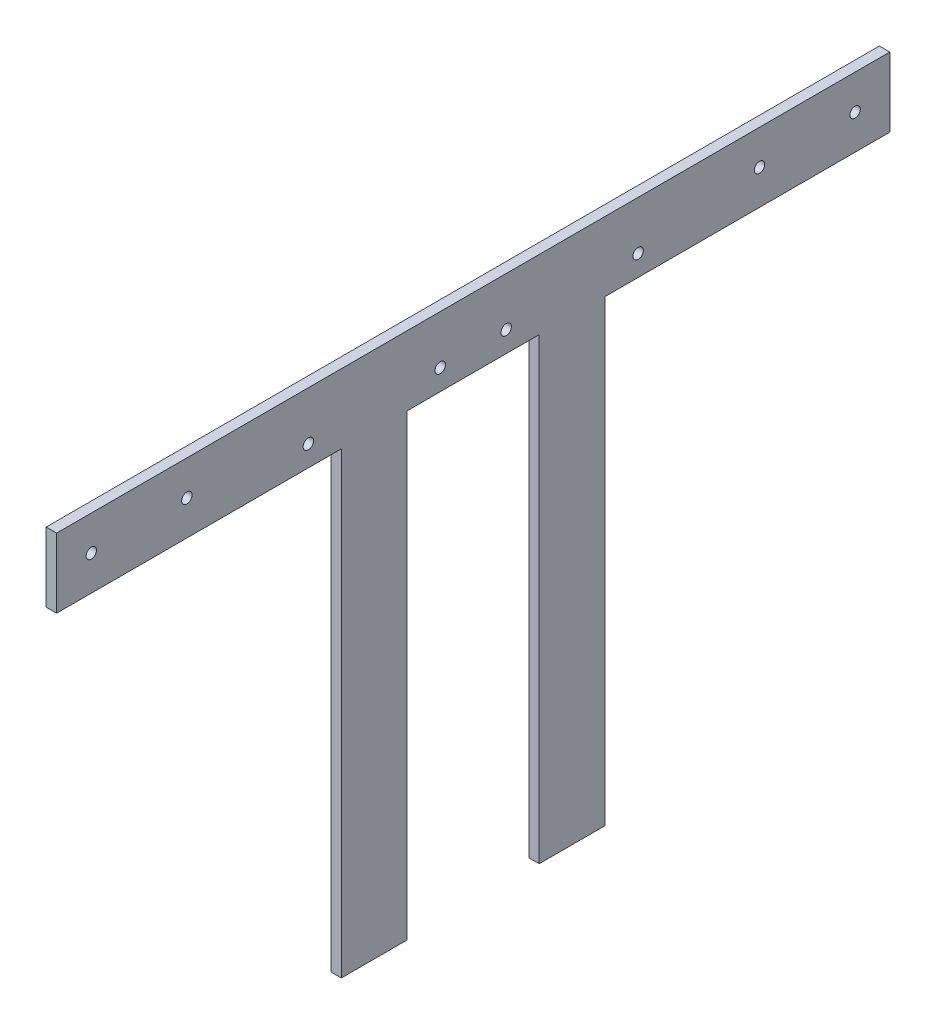
ISO-10303-21;
HEADER;
FILE_DESCRIPTION(('STEP AP214'),'2;1');
FILE_NAME('part.step','',(''),(''),'','','');
FILE_SCHEMA(('AUTOMOTIVE_DESIGN { 1 0 10303 214 1 1 1 1 }'));
ENDSEC;
DATA;
#1=APPLICATION_CONTEXT('core data for automotive mechanical design processes');
#2=APPLICATION_PROTOCOL_DEFINITION('international standard','automotive_design',2000,#1);
#3=PRODUCT_CONTEXT('',#1,'mechanical');
#4=PRODUCT('Part','Part','',(#3));
#5=PRODUCT_RELATED_PRODUCT_CATEGORY('part','',(#4));
#6=PRODUCT_DEFINITION_FORMATION('','',#4);
#7=PRODUCT_DEFINITION_CONTEXT('part definition',#1,'design');
#8=PRODUCT_DEFINITION('design','',#6,#7);
#9=PRODUCT_DEFINITION_SHAPE('','',#8);
#10=(LENGTH_UNIT() NAMED_UNIT(*) SI_UNIT(.MILLI.,.METRE.));
#11=(NAMED_UNIT(*) PLANE_ANGLE_UNIT() SI_UNIT($,.RADIAN.));
#12=(NAMED_UNIT(*) SI_UNIT($,.STERADIAN.) SOLID_ANGLE_UNIT());
#13=UNCERTAINTY_MEASURE_WITH_UNIT(LENGTH_MEASURE(1.E-05),#10,'distance_accuracy_value','');
#14=(GEOMETRIC_REPRESENTATION_CONTEXT(3) GLOBAL_UNCERTAINTY_ASSIGNED_CONTEXT((#13)) GLOBAL_UNIT_ASSIGNED_CONTEXT((#10,
#11,#12)) REPRESENTATION_CONTEXT('',''));
#15=CARTESIAN_POINT('',(0.,0.,0.));
#16=DIRECTION('',(0.,0.,1.));
#17=DIRECTION('',(1.,0.,0.));
#18=AXIS2_PLACEMENT_3D('',#15,#16,#17);
#19=CARTESIAN_POINT('',(3.,0.,0.));
#20=DIRECTION('',(1.,0.,0.));
#21=DIRECTION('',(0.,0.,-1.));
#22=AXIS2_PLACEMENT_3D('',#19,#20,#21);
#23=PLANE('',#22);
#24=CARTESIAN_POINT('',(3.,-10.,-37.52));
#25=DIRECTION('',(1.,0.,0.));
#26=DIRECTION('',(0.,0.,-1.));
#27=AXIS2_PLACEMENT_3D('',#24,#25,#26);
#28=CIRCLE('',#27,1.5);
#29=CARTESIAN_POINT('',(3.,-10.,-39.02));
#30=VERTEX_POINT('',#29);
#31=EDGE_CURVE('E309',#30,#30,#28,.T.);
#32=ORIENTED_EDGE('',*,*,#31,.F.);
#33=EDGE_LOOP('',(#32));
#34=FACE_BOUND('',#33,.T.);
#35=CARTESIAN_POINT('',(3.,-10.,-10.));
#36=DIRECTION('',(1.,0.,0.));
#37=DIRECTION('',(0.,0.,-1.));
#38=AXIS2_PLACEMENT_3D('',#35,#36,#37);
#39=CIRCLE('',#38,1.5);
#40=CARTESIAN_POINT('',(3.,-10.,-11.5));
#41=VERTEX_POINT('',#40);
#42=EDGE_CURVE('E321',#41,#41,#39,.T.);
#43=ORIENTED_EDGE('',*,*,#42,.F.);
#44=EDGE_LOOP('',(#43));
#45=FACE_BOUND('',#44,.T.);
#46=CARTESIAN_POINT('',(3.,-14.,-129.5));
#47=DIRECTION('',(1.,0.,0.));
#48=DIRECTION('',(0.,0.,1.));
#49=AXIS2_PLACEMENT_3D('',#46,#47,#48);
#50=CIRCLE('',#49,1.5);
#51=CARTESIAN_POINT('',(3.,-14.,-128.));
#52=VERTEX_POINT('',#51);
#53=EDGE_CURVE('E333',#52,#52,#50,.T.);
#54=ORIENTED_EDGE('',*,*,#53,.F.);
#55=EDGE_LOOP('',(#54));
#56=FACE_BOUND('',#55,.T.);
#57=CARTESIAN_POINT('',(3.,-14.,-72.5));
#58=DIRECTION('',(1.,0.,0.));
#59=DIRECTION('',(0.,0.,-1.));
#60=AXIS2_PLACEMENT_3D('',#57,#58,#59);
#61=CIRCLE('',#60,1.5);
#62=CARTESIAN_POINT('',(3.,-14.,-74.));
#63=VERTEX_POINT('',#62);
#64=EDGE_CURVE('E160',#63,#63,#61,.T.);
#65=ORIENTED_EDGE('',*,*,#64,.F.);
#66=EDGE_LOOP('',(#65));
#67=FACE_BOUND('',#66,.T.);
#68=DIRECTION('',(0.,-1.,0.));
#69=VECTOR('',#68,1.);
#70=CARTESIAN_POINT('',(3.,0.,0.));
#71=LINE('',#70,#69);
#72=CARTESIAN_POINT('',(3.,0.,0.));
#73=VERTEX_POINT('',#72);
#74=CARTESIAN_POINT('',(3.,-20.,0.));
#75=VERTEX_POINT('',#74);
#76=EDGE_CURVE('E179',#73,#75,#71,.T.);
#77=ORIENTED_EDGE('',*,*,#76,.T.);
#78=DIRECTION('',(0.,0.,-1.));
#79=VECTOR('',#78,1.);
#80=CARTESIAN_POINT('',(3.,-20.,0.));
#81=LINE('',#80,#79);
#82=CARTESIAN_POINT('',(3.,-20.,-82.));
#83=VERTEX_POINT('',#82);
#84=EDGE_CURVE('E107',#75,#83,#81,.T.);
#85=ORIENTED_EDGE('',*,*,#84,.T.);
#86=DIRECTION('',(0.,-1.,0.));
#87=VECTOR('',#86,1.);
#88=CARTESIAN_POINT('',(3.,-20.,-82.));
#89=LINE('',#88,#87);
#90=CARTESIAN_POINT('',(3.,-152.,-82.));
#91=VERTEX_POINT('',#90);
#92=EDGE_CURVE('E206',#83,#91,#89,.T.);
#93=ORIENTED_EDGE('',*,*,#92,.T.);
#94=DIRECTION('',(0.,0.,-1.));
#95=VECTOR('',#94,1.);
#96=CARTESIAN_POINT('',(3.,-152.,-82.));
#97=LINE('',#96,#95);
#98=CARTESIAN_POINT('',(3.,-152.,-101.));
#99=VERTEX_POINT('',#98);
#100=EDGE_CURVE('E225',#91,#99,#97,.T.);
#101=ORIENTED_EDGE('',*,*,#100,.T.);
#102=DIRECTION('',(0.,1.,0.));
#103=VECTOR('',#102,1.);
#104=CARTESIAN_POINT('',(3.,-20.,-101.));
#105=LINE('',#104,#103);
#106=CARTESIAN_POINT('',(3.,-20.,-101.));
#107=VERTEX_POINT('',#106);
#108=EDGE_CURVE('E222',#99,#107,#105,.T.);
#109=ORIENTED_EDGE('',*,*,#108,.T.);
#110=DIRECTION('',(0.,0.,-1.));
#111=VECTOR('',#110,1.);
#112=CARTESIAN_POINT('',(3.,-20.,-101.));
#113=LINE('',#112,#111);
#114=CARTESIAN_POINT('',(3.,-20.,-139.));
#115=VERTEX_POINT('',#114);
#116=EDGE_CURVE('E224',#107,#115,#113,.T.);
#117=ORIENTED_EDGE('',*,*,#116,.T.);
#118=DIRECTION('',(0.,-1.,0.));
#119=VECTOR('',#118,1.);
#120=CARTESIAN_POINT('',(3.,-20.,-139.));
#121=LINE('',#120,#119);
#122=CARTESIAN_POINT('',(3.,-152.,-139.));
#123=VERTEX_POINT('',#122);
#124=EDGE_CURVE('E227',#115,#123,#121,.T.);
#125=ORIENTED_EDGE('',*,*,#124,.T.);
#126=DIRECTION('',(0.,0.,-1.));
#127=VECTOR('',#126,1.);
#128=CARTESIAN_POINT('',(3.,-152.,-158.));
#129=LINE('',#128,#127);
#130=CARTESIAN_POINT('',(3.,-152.,-158.));
#131=VERTEX_POINT('',#130);
#132=EDGE_CURVE('E233',#123,#131,#129,.T.);
#133=ORIENTED_EDGE('',*,*,#132,.T.);
#134=DIRECTION('',(0.,1.,0.));
#135=VECTOR('',#134,1.);
#136=CARTESIAN_POINT('',(3.,-20.,-158.));
#137=LINE('',#136,#135);
#138=CARTESIAN_POINT('',(3.,-20.,-158.));
#139=VERTEX_POINT('',#138);
#140=EDGE_CURVE('E138',#131,#139,#137,.T.);
#141=ORIENTED_EDGE('',*,*,#140,.T.);
#142=DIRECTION('',(0.,0.,-1.));
#143=VECTOR('',#142,1.);
#144=CARTESIAN_POINT('',(3.,-20.,-158.));
#145=LINE('',#144,#143);
#146=CARTESIAN_POINT('',(3.,-20.,-240.));
#147=VERTEX_POINT('',#146);
#148=EDGE_CURVE('E132',#139,#147,#145,.T.);
#149=ORIENTED_EDGE('',*,*,#148,.T.);
#150=DIRECTION('',(0.,1.,0.));
#151=VECTOR('',#150,1.);
#152=CARTESIAN_POINT('',(3.,0.,-240.));
#153=LINE('',#152,#151);
#154=CARTESIAN_POINT('',(3.,0.,-240.));
#155=VERTEX_POINT('',#154);
#156=EDGE_CURVE('E136',#147,#155,#153,.T.);
#157=ORIENTED_EDGE('',*,*,#156,.T.);
#158=DIRECTION('',(0.,0.,1.));
#159=VECTOR('',#158,1.);
#160=CARTESIAN_POINT('',(3.,0.,0.));
#161=LINE('',#160,#159);
#162=EDGE_CURVE('E52',#155,#73,#161,.T.);
#163=ORIENTED_EDGE('',*,*,#162,.T.);
#164=EDGE_LOOP('',(#77,#85,#93,#101,#109,#117,#125,#133,#141,#149,#157,#163));
#165=FACE_BOUND('',#164,.T.);
#166=CARTESIAN_POINT('',(3.,-14.,-110.5));
#167=DIRECTION('',(1.,0.,0.));
#168=DIRECTION('',(0.,0.,-1.));
#169=AXIS2_PLACEMENT_3D('',#166,#167,#168);
#170=CIRCLE('',#169,1.5);
#171=CARTESIAN_POINT('',(3.,-14.,-112.));
#172=VERTEX_POINT('',#171);
#173=EDGE_CURVE('E339',#172,#172,#170,.T.);
#174=ORIENTED_EDGE('',*,*,#173,.F.);
#175=EDGE_LOOP('',(#174));
#176=FACE_BOUND('',#175,.T.);
#177=CARTESIAN_POINT('',(3.,-14.,-167.5));
#178=DIRECTION('',(1.,0.,0.));
#179=DIRECTION('',(0.,0.,1.));
#180=AXIS2_PLACEMENT_3D('',#177,#178,#179);
#181=CIRCLE('',#180,1.5);
#182=CARTESIAN_POINT('',(3.,-14.,-166.));
#183=VERTEX_POINT('',#182);
#184=EDGE_CURVE('E327',#183,#183,#181,.T.);
#185=ORIENTED_EDGE('',*,*,#184,.F.);
#186=EDGE_LOOP('',(#185));
#187=FACE_BOUND('',#186,.T.);
#188=CARTESIAN_POINT('',(3.,-10.,-230.));
#189=DIRECTION('',(1.,0.,0.));
#190=DIRECTION('',(0.,0.,1.));
#191=AXIS2_PLACEMENT_3D('',#188,#189,#190);
#192=CIRCLE('',#191,1.50000000000002);
#193=CARTESIAN_POINT('',(3.,-10.,-228.5));
#194=VERTEX_POINT('',#193);
#195=EDGE_CURVE('E315',#194,#194,#192,.T.);
#196=ORIENTED_EDGE('',*,*,#195,.F.);
#197=EDGE_LOOP('',(#196));
#198=FACE_BOUND('',#197,.T.);
#199=CARTESIAN_POINT('',(3.,-10.,-202.48));
#200=DIRECTION('',(1.,0.,0.));
#201=DIRECTION('',(0.,0.,1.));
#202=AXIS2_PLACEMENT_3D('',#199,#200,#201);
#203=CIRCLE('',#202,1.49999999999997);
#204=CARTESIAN_POINT('',(3.,-10.,-200.98));
#205=VERTEX_POINT('',#204);
#206=EDGE_CURVE('E300',#205,#205,#203,.T.);
#207=ORIENTED_EDGE('',*,*,#206,.F.);
#208=EDGE_LOOP('',(#207));
#209=FACE_BOUND('',#208,.T.);
#210=ADVANCED_FACE('F35',(#34,#45,#56,#67,#165,#176,#187,#198,#209),#23,.T.);
#211=CARTESIAN_POINT('',(0.,0.,0.));
#212=DIRECTION('',(1.,0.,0.));
#213=DIRECTION('',(0.,0.,-1.));
#214=AXIS2_PLACEMENT_3D('',#211,#212,#213);
#215=PLANE('',#214);
#216=DIRECTION('',(0.,-1.,0.));
#217=VECTOR('',#216,1.);
#218=CARTESIAN_POINT('',(0.,0.,0.));
#219=LINE('',#218,#217);
#220=CARTESIAN_POINT('',(0.,0.,0.));
#221=VERTEX_POINT('',#220);
#222=CARTESIAN_POINT('',(0.,-20.,0.));
#223=VERTEX_POINT('',#222);
#224=EDGE_CURVE('E156',#221,#223,#219,.T.);
#225=ORIENTED_EDGE('',*,*,#224,.F.);
#226=DIRECTION('',(0.,0.,1.));
#227=VECTOR('',#226,1.);
#228=CARTESIAN_POINT('',(0.,0.,0.));
#229=LINE('',#228,#227);
#230=CARTESIAN_POINT('',(0.,0.,-240.));
#231=VERTEX_POINT('',#230);
#232=EDGE_CURVE('E99',#231,#221,#229,.T.);
#233=ORIENTED_EDGE('',*,*,#232,.F.);
#234=DIRECTION('',(0.,1.,0.));
#235=VECTOR('',#234,1.);
#236=CARTESIAN_POINT('',(0.,0.,-240.));
#237=LINE('',#236,#235);
#238=CARTESIAN_POINT('',(0.,-20.,-240.));
#239=VERTEX_POINT('',#238);
#240=EDGE_CURVE('E93',#239,#231,#237,.T.);
#241=ORIENTED_EDGE('',*,*,#240,.F.);
#242=DIRECTION('',(0.,0.,-1.));
#243=VECTOR('',#242,1.);
#244=CARTESIAN_POINT('',(0.,-20.,-158.));
#245=LINE('',#244,#243);
#246=CARTESIAN_POINT('',(0.,-20.,-158.));
#247=VERTEX_POINT('',#246);
#248=EDGE_CURVE('E146',#247,#239,#245,.T.);
#249=ORIENTED_EDGE('',*,*,#248,.F.);
#250=DIRECTION('',(0.,1.,0.));
#251=VECTOR('',#250,1.);
#252=CARTESIAN_POINT('',(0.,-20.,-158.));
#253=LINE('',#252,#251);
#254=CARTESIAN_POINT('',(0.,-152.,-158.));
#255=VERTEX_POINT('',#254);
#256=EDGE_CURVE('E174',#255,#247,#253,.T.);
#257=ORIENTED_EDGE('',*,*,#256,.F.);
#258=DIRECTION('',(0.,0.,-1.));
#259=VECTOR('',#258,1.);
#260=CARTESIAN_POINT('',(0.,-152.,-158.));
#261=LINE('',#260,#259);
#262=CARTESIAN_POINT('',(0.,-152.,-139.));
#263=VERTEX_POINT('',#262);
#264=EDGE_CURVE('E172',#263,#255,#261,.T.);
#265=ORIENTED_EDGE('',*,*,#264,.F.);
#266=DIRECTION('',(0.,-1.,0.));
#267=VECTOR('',#266,1.);
#268=CARTESIAN_POINT('',(0.,-20.,-139.));
#269=LINE('',#268,#267);
#270=CARTESIAN_POINT('',(0.,-20.,-139.));
#271=VERTEX_POINT('',#270);
#272=EDGE_CURVE('E170',#271,#263,#269,.T.);
#273=ORIENTED_EDGE('',*,*,#272,.F.);
#274=DIRECTION('',(0.,0.,-1.));
#275=VECTOR('',#274,1.);
#276=CARTESIAN_POINT('',(0.,-20.,-101.));
#277=LINE('',#276,#275);
#278=CARTESIAN_POINT('',(0.,-20.,-101.));
#279=VERTEX_POINT('',#278);
#280=EDGE_CURVE('E168',#279,#271,#277,.T.);
#281=ORIENTED_EDGE('',*,*,#280,.F.);
#282=DIRECTION('',(0.,1.,0.));
#283=VECTOR('',#282,1.);
#284=CARTESIAN_POINT('',(0.,-20.,-101.));
#285=LINE('',#284,#283);
#286=CARTESIAN_POINT('',(0.,-152.,-101.));
#287=VERTEX_POINT('',#286);
#288=EDGE_CURVE('E166',#287,#279,#285,.T.);
#289=ORIENTED_EDGE('',*,*,#288,.F.);
#290=DIRECTION('',(0.,0.,-1.));
#291=VECTOR('',#290,1.);
#292=CARTESIAN_POINT('',(0.,-152.,-82.));
#293=LINE('',#292,#291);
#294=CARTESIAN_POINT('',(0.,-152.,-82.));
#295=VERTEX_POINT('',#294);
#296=EDGE_CURVE('E164',#295,#287,#293,.T.);
#297=ORIENTED_EDGE('',*,*,#296,.F.);
#298=DIRECTION('',(0.,-1.,0.));
#299=VECTOR('',#298,1.);
#300=CARTESIAN_POINT('',(0.,-20.,-82.));
#301=LINE('',#300,#299);
#302=CARTESIAN_POINT('',(0.,-20.,-82.));
#303=VERTEX_POINT('',#302);
#304=EDGE_CURVE('E162',#303,#295,#301,.T.);
#305=ORIENTED_EDGE('',*,*,#304,.F.);
#306=DIRECTION('',(0.,0.,-1.));
#307=VECTOR('',#306,1.);
#308=CARTESIAN_POINT('',(0.,-20.,0.));
#309=LINE('',#308,#307);
#310=EDGE_CURVE('E159',#223,#303,#309,.T.);
#311=ORIENTED_EDGE('',*,*,#310,.F.);
#312=EDGE_LOOP('',(#225,#233,#241,#249,#257,#265,#273,#281,#289,#297,#305,#311));
#313=FACE_BOUND('',#312,.T.);
#314=CARTESIAN_POINT('',(0.,-14.,-72.5));
#315=DIRECTION('',(1.,0.,0.));
#316=DIRECTION('',(0.,0.,-1.));
#317=AXIS2_PLACEMENT_3D('',#314,#315,#316);
#318=CIRCLE('',#317,1.5);
#319=CARTESIAN_POINT('',(0.,-14.,-74.));
#320=VERTEX_POINT('',#319);
#321=EDGE_CURVE('E342',#320,#320,#318,.T.);
#322=ORIENTED_EDGE('',*,*,#321,.T.);
#323=EDGE_LOOP('',(#322));
#324=FACE_BOUND('',#323,.T.);
#325=CARTESIAN_POINT('',(0.,-14.,-110.5));
#326=DIRECTION('',(1.,0.,0.));
#327=DIRECTION('',(0.,0.,-1.));
#328=AXIS2_PLACEMENT_3D('',#325,#326,#327);
#329=CIRCLE('',#328,1.5);
#330=CARTESIAN_POINT('',(0.,-14.,-112.));
#331=VERTEX_POINT('',#330);
#332=EDGE_CURVE('E336',#331,#331,#329,.T.);
#333=ORIENTED_EDGE('',*,*,#332,.T.);
#334=EDGE_LOOP('',(#333));
#335=FACE_BOUND('',#334,.T.);
#336=CARTESIAN_POINT('',(0.,-14.,-129.5));
#337=DIRECTION('',(1.,0.,0.));
#338=DIRECTION('',(0.,0.,1.));
#339=AXIS2_PLACEMENT_3D('',#336,#337,#338);
#340=CIRCLE('',#339,1.5);
#341=CARTESIAN_POINT('',(0.,-14.,-128.));
#342=VERTEX_POINT('',#341);
#343=EDGE_CURVE('E330',#342,#342,#340,.T.);
#344=ORIENTED_EDGE('',*,*,#343,.T.);
#345=EDGE_LOOP('',(#344));
#346=FACE_BOUND('',#345,.T.);
#347=CARTESIAN_POINT('',(0.,-14.,-167.5));
#348=DIRECTION('',(1.,0.,0.));
#349=DIRECTION('',(0.,0.,1.));
#350=AXIS2_PLACEMENT_3D('',#347,#348,#349);
#351=CIRCLE('',#350,1.5);
#352=CARTESIAN_POINT('',(0.,-14.,-166.));
#353=VERTEX_POINT('',#352);
#354=EDGE_CURVE('E324',#353,#353,#351,.T.);
#355=ORIENTED_EDGE('',*,*,#354,.T.);
#356=EDGE_LOOP('',(#355));
#357=FACE_BOUND('',#356,.T.);
#358=CARTESIAN_POINT('',(0.,-10.,-10.));
#359=DIRECTION('',(1.,0.,0.));
#360=DIRECTION('',(0.,0.,-1.));
#361=AXIS2_PLACEMENT_3D('',#358,#359,#360);
#362=CIRCLE('',#361,1.5);
#363=CARTESIAN_POINT('',(0.,-10.,-11.5));
#364=VERTEX_POINT('',#363);
#365=EDGE_CURVE('E318',#364,#364,#362,.T.);
#366=ORIENTED_EDGE('',*,*,#365,.T.);
#367=EDGE_LOOP('',(#366));
#368=FACE_BOUND('',#367,.T.);
#369=CARTESIAN_POINT('',(0.,-10.,-230.));
#370=DIRECTION('',(1.,0.,0.));
#371=DIRECTION('',(0.,0.,1.));
#372=AXIS2_PLACEMENT_3D('',#369,#370,#371);
#373=CIRCLE('',#372,1.50000000000002);
#374=CARTESIAN_POINT('',(0.,-10.,-228.5));
#375=VERTEX_POINT('',#374);
#376=EDGE_CURVE('E312',#375,#375,#373,.T.);
#377=ORIENTED_EDGE('',*,*,#376,.T.);
#378=EDGE_LOOP('',(#377));
#379=FACE_BOUND('',#378,.T.);
#380=CARTESIAN_POINT('',(0.,-10.,-37.52));
#381=DIRECTION('',(1.,0.,0.));
#382=DIRECTION('',(0.,0.,-1.));
#383=AXIS2_PLACEMENT_3D('',#380,#381,#382);
#384=CIRCLE('',#383,1.5);
#385=CARTESIAN_POINT('',(0.,-10.,-39.02));
#386=VERTEX_POINT('',#385);
#387=EDGE_CURVE('E306',#386,#386,#384,.T.);
#388=ORIENTED_EDGE('',*,*,#387,.T.);
#389=EDGE_LOOP('',(#388));
#390=FACE_BOUND('',#389,.T.);
#391=CARTESIAN_POINT('',(0.,-10.,-202.48));
#392=DIRECTION('',(1.,0.,0.));
#393=DIRECTION('',(0.,0.,1.));
#394=AXIS2_PLACEMENT_3D('',#391,#392,#393);
#395=CIRCLE('',#394,1.49999999999997);
#396=CARTESIAN_POINT('',(0.,-10.,-200.98));
#397=VERTEX_POINT('',#396);
#398=EDGE_CURVE('E303',#397,#397,#395,.T.);
#399=ORIENTED_EDGE('',*,*,#398,.T.);
#400=EDGE_LOOP('',(#399));
#401=FACE_BOUND('',#400,.T.);
#402=ADVANCED_FACE('F210',(#313,#324,#335,#346,#357,#368,#379,#390,#401),#215,.F.);
#403=CARTESIAN_POINT('',(3.,0.,0.));
#404=DIRECTION('',(0.,0.,-1.));
#405=DIRECTION('',(0.,1.,0.));
#406=AXIS2_PLACEMENT_3D('',#403,#404,#405);
#407=PLANE('',#406);
#408=ORIENTED_EDGE('',*,*,#224,.T.);
#409=DIRECTION('',(-1.,0.,0.));
#410=VECTOR('',#409,1.);
#411=CARTESIAN_POINT('',(3.,-20.,0.));
#412=LINE('',#411,#410);
#413=EDGE_CURVE('E11',#75,#223,#412,.T.);
#414=ORIENTED_EDGE('',*,*,#413,.F.);
#415=ORIENTED_EDGE('',*,*,#76,.F.);
#416=DIRECTION('',(-1.,0.,0.));
#417=VECTOR('',#416,1.);
#418=CARTESIAN_POINT('',(3.,0.,0.));
#419=LINE('',#418,#417);
#420=EDGE_CURVE('E152',#73,#221,#419,.T.);
#421=ORIENTED_EDGE('',*,*,#420,.T.);
#422=EDGE_LOOP('',(#408,#414,#415,#421));
#423=FACE_BOUND('',#422,.T.);
#424=ADVANCED_FACE('F37',(#423),#407,.F.);
#425=CARTESIAN_POINT('',(3.,-20.,0.));
#426=DIRECTION('',(0.,1.,0.));
#427=DIRECTION('',(0.,0.,1.));
#428=AXIS2_PLACEMENT_3D('',#425,#426,#427);
#429=PLANE('',#428);
#430=ORIENTED_EDGE('',*,*,#310,.T.);
#431=DIRECTION('',(-1.,0.,0.));
#432=VECTOR('',#431,1.);
#433=CARTESIAN_POINT('',(3.,-20.,-82.));
#434=LINE('',#433,#432);
#435=EDGE_CURVE('E44',#83,#303,#434,.T.);
#436=ORIENTED_EDGE('',*,*,#435,.F.);
#437=ORIENTED_EDGE('',*,*,#84,.F.);
#438=ORIENTED_EDGE('',*,*,#413,.T.);
#439=EDGE_LOOP('',(#430,#436,#437,#438));
#440=FACE_BOUND('',#439,.T.);
#441=ADVANCED_FACE('F488',(#440),#429,.F.);
#442=CARTESIAN_POINT('',(3.,-20.,-82.));
#443=DIRECTION('',(0.,0.,-1.));
#444=DIRECTION('',(0.,1.,0.));
#445=AXIS2_PLACEMENT_3D('',#442,#443,#444);
#446=PLANE('',#445);
#447=ORIENTED_EDGE('',*,*,#304,.T.);
#448=DIRECTION('',(-1.,0.,0.));
#449=VECTOR('',#448,1.);
#450=CARTESIAN_POINT('',(3.,-152.,-82.));
#451=LINE('',#450,#449);
#452=EDGE_CURVE('E198',#91,#295,#451,.T.);
#453=ORIENTED_EDGE('',*,*,#452,.F.);
#454=ORIENTED_EDGE('',*,*,#92,.F.);
#455=ORIENTED_EDGE('',*,*,#435,.T.);
#456=EDGE_LOOP('',(#447,#453,#454,#455));
#457=FACE_BOUND('',#456,.T.);
#458=ADVANCED_FACE('F204',(#457),#446,.F.);
#459=CARTESIAN_POINT('',(3.,-152.,-82.));
#460=DIRECTION('',(0.,1.,0.));
#461=DIRECTION('',(0.,0.,1.));
#462=AXIS2_PLACEMENT_3D('',#459,#460,#461);
#463=PLANE('',#462);
#464=ORIENTED_EDGE('',*,*,#296,.T.);
#465=DIRECTION('',(-1.,0.,0.));
#466=VECTOR('',#465,1.);
#467=CARTESIAN_POINT('',(3.,-152.,-101.));
#468=LINE('',#467,#466);
#469=EDGE_CURVE('E195',#99,#287,#468,.T.);
#470=ORIENTED_EDGE('',*,*,#469,.F.);
#471=ORIENTED_EDGE('',*,*,#100,.F.);
#472=ORIENTED_EDGE('',*,*,#452,.T.);
#473=EDGE_LOOP('',(#464,#470,#471,#472));
#474=FACE_BOUND('',#473,.T.);
#475=ADVANCED_FACE('F216',(#474),#463,.F.);
#476=CARTESIAN_POINT('',(3.,-20.,-101.));
#477=DIRECTION('',(0.,0.,1.));
#478=DIRECTION('',(0.,-1.,0.));
#479=AXIS2_PLACEMENT_3D('',#476,#477,#478);
#480=PLANE('',#479);
#481=ORIENTED_EDGE('',*,*,#288,.T.);
#482=DIRECTION('',(-1.,0.,0.));
#483=VECTOR('',#482,1.);
#484=CARTESIAN_POINT('',(3.,-20.,-101.));
#485=LINE('',#484,#483);
#486=EDGE_CURVE('E192',#107,#279,#485,.T.);
#487=ORIENTED_EDGE('',*,*,#486,.F.);
#488=ORIENTED_EDGE('',*,*,#108,.F.);
#489=ORIENTED_EDGE('',*,*,#469,.T.);
#490=EDGE_LOOP('',(#481,#487,#488,#489));
#491=FACE_BOUND('',#490,.T.);
#492=ADVANCED_FACE('F220',(#491),#480,.F.);
#493=CARTESIAN_POINT('',(3.,-20.,-101.));
#494=DIRECTION('',(0.,1.,0.));
#495=DIRECTION('',(0.,0.,1.));
#496=AXIS2_PLACEMENT_3D('',#493,#494,#495);
#497=PLANE('',#496);
#498=ORIENTED_EDGE('',*,*,#280,.T.);
#499=DIRECTION('',(-1.,0.,0.));
#500=VECTOR('',#499,1.);
#501=CARTESIAN_POINT('',(3.,-20.,-139.));
#502=LINE('',#501,#500);
#503=EDGE_CURVE('E189',#115,#271,#502,.T.);
#504=ORIENTED_EDGE('',*,*,#503,.F.);
#505=ORIENTED_EDGE('',*,*,#116,.F.);
#506=ORIENTED_EDGE('',*,*,#486,.T.);
#507=EDGE_LOOP('',(#498,#504,#505,#506));
#508=FACE_BOUND('',#507,.T.);
#509=ADVANCED_FACE('F453',(#508),#497,.F.);
#510=CARTESIAN_POINT('',(3.,-20.,-139.));
#511=DIRECTION('',(0.,0.,-1.));
#512=DIRECTION('',(-1.,0.,0.));
#513=AXIS2_PLACEMENT_3D('',#510,#511,#512);
#514=PLANE('',#513);
#515=ORIENTED_EDGE('',*,*,#272,.T.);
#516=DIRECTION('',(-1.,0.,0.));
#517=VECTOR('',#516,1.);
#518=CARTESIAN_POINT('',(3.,-152.,-139.));
#519=LINE('',#518,#517);
#520=EDGE_CURVE('E186',#123,#263,#519,.T.);
#521=ORIENTED_EDGE('',*,*,#520,.F.);
#522=ORIENTED_EDGE('',*,*,#124,.F.);
#523=ORIENTED_EDGE('',*,*,#503,.T.);
#524=EDGE_LOOP('',(#515,#521,#522,#523));
#525=FACE_BOUND('',#524,.T.);
#526=ADVANCED_FACE('F444',(#525),#514,.F.);
#527=CARTESIAN_POINT('',(3.,-152.,-158.));
#528=DIRECTION('',(0.,1.,0.));
#529=DIRECTION('',(0.,0.,1.));
#530=AXIS2_PLACEMENT_3D('',#527,#528,#529);
#531=PLANE('',#530);
#532=ORIENTED_EDGE('',*,*,#264,.T.);
#533=DIRECTION('',(-1.,0.,0.));
#534=VECTOR('',#533,1.);
#535=CARTESIAN_POINT('',(3.,-152.,-158.));
#536=LINE('',#535,#534);
#537=EDGE_CURVE('E183',#131,#255,#536,.T.);
#538=ORIENTED_EDGE('',*,*,#537,.F.);
#539=ORIENTED_EDGE('',*,*,#132,.F.);
#540=ORIENTED_EDGE('',*,*,#520,.T.);
#541=EDGE_LOOP('',(#532,#538,#539,#540));
#542=FACE_BOUND('',#541,.T.);
#543=ADVANCED_FACE('F239',(#542),#531,.F.);
#544=CARTESIAN_POINT('',(3.,-20.,-158.));
#545=DIRECTION('',(0.,0.,1.));
#546=DIRECTION('',(0.,-1.,0.));
#547=AXIS2_PLACEMENT_3D('',#544,#545,#546);
#548=PLANE('',#547);
#549=ORIENTED_EDGE('',*,*,#256,.T.);
#550=DIRECTION('',(-1.,0.,0.));
#551=VECTOR('',#550,1.);
#552=CARTESIAN_POINT('',(3.,-20.,-158.));
#553=LINE('',#552,#551);
#554=EDGE_CURVE('E147',#139,#247,#553,.T.);
#555=ORIENTED_EDGE('',*,*,#554,.F.);
#556=ORIENTED_EDGE('',*,*,#140,.F.);
#557=ORIENTED_EDGE('',*,*,#537,.T.);
#558=EDGE_LOOP('',(#549,#555,#556,#557));
#559=FACE_BOUND('',#558,.T.);
#560=ADVANCED_FACE('F243',(#559),#548,.F.);
#561=CARTESIAN_POINT('',(3.,-20.,-158.));
#562=DIRECTION('',(0.,1.,0.));
#563=DIRECTION('',(0.,0.,1.));
#564=AXIS2_PLACEMENT_3D('',#561,#562,#563);
#565=PLANE('',#564);
#566=ORIENTED_EDGE('',*,*,#248,.T.);
#567=DIRECTION('',(-1.,0.,0.));
#568=VECTOR('',#567,1.);
#569=CARTESIAN_POINT('',(3.,-20.,-240.));
#570=LINE('',#569,#568);
#571=EDGE_CURVE('E143',#147,#239,#570,.T.);
#572=ORIENTED_EDGE('',*,*,#571,.F.);
#573=ORIENTED_EDGE('',*,*,#148,.F.);
#574=ORIENTED_EDGE('',*,*,#554,.T.);
#575=EDGE_LOOP('',(#566,#572,#573,#574));
#576=FACE_BOUND('',#575,.T.);
#577=ADVANCED_FACE('F144',(#576),#565,.F.);
#578=CARTESIAN_POINT('',(3.,0.,-240.));
#579=DIRECTION('',(0.,0.,1.));
#580=DIRECTION('',(1.,0.,0.));
#581=AXIS2_PLACEMENT_3D('',#578,#579,#580);
#582=PLANE('',#581);
#583=ORIENTED_EDGE('',*,*,#240,.T.);
#584=DIRECTION('',(-1.,0.,0.));
#585=VECTOR('',#584,1.);
#586=CARTESIAN_POINT('',(3.,0.,-240.));
#587=LINE('',#586,#585);
#588=EDGE_CURVE('E148',#155,#231,#587,.T.);
#589=ORIENTED_EDGE('',*,*,#588,.F.);
#590=ORIENTED_EDGE('',*,*,#156,.F.);
#591=ORIENTED_EDGE('',*,*,#571,.T.);
#592=EDGE_LOOP('',(#583,#589,#590,#591));
#593=FACE_BOUND('',#592,.T.);
#594=ADVANCED_FACE('F150',(#593),#582,.F.);
#595=CARTESIAN_POINT('',(3.,0.,0.));
#596=DIRECTION('',(0.,-1.,0.));
#597=DIRECTION('',(0.,0.,-1.));
#598=AXIS2_PLACEMENT_3D('',#595,#596,#597);
#599=PLANE('',#598);
#600=ORIENTED_EDGE('',*,*,#232,.T.);
#601=ORIENTED_EDGE('',*,*,#420,.F.);
#602=ORIENTED_EDGE('',*,*,#162,.F.);
#603=ORIENTED_EDGE('',*,*,#588,.T.);
#604=EDGE_LOOP('',(#600,#601,#602,#603));
#605=FACE_BOUND('',#604,.T.);
#606=ADVANCED_FACE('F247',(#605),#599,.F.);
#607=CARTESIAN_POINT('',(3.,-14.,-72.5));
#608=DIRECTION('',(-1.,0.,0.));
#609=DIRECTION('',(0.,0.,1.));
#610=AXIS2_PLACEMENT_3D('',#607,#608,#609);
#611=CYLINDRICAL_SURFACE('',#610,1.5);
#612=ORIENTED_EDGE('',*,*,#64,.T.);
#613=EDGE_LOOP('',(#612));
#614=FACE_BOUND('',#613,.T.);
#615=ORIENTED_EDGE('',*,*,#321,.F.);
#616=EDGE_LOOP('',(#615));
#617=FACE_BOUND('',#616,.T.);
#618=ADVANCED_FACE('F249',(#614,#617),#611,.F.);
#619=CARTESIAN_POINT('',(3.,-14.,-110.5));
#620=DIRECTION('',(-1.,0.,0.));
#621=DIRECTION('',(0.,0.,1.));
#622=AXIS2_PLACEMENT_3D('',#619,#620,#621);
#623=CYLINDRICAL_SURFACE('',#622,1.5);
#624=ORIENTED_EDGE('',*,*,#173,.T.);
#625=EDGE_LOOP('',(#624));
#626=FACE_BOUND('',#625,.T.);
#627=ORIENTED_EDGE('',*,*,#332,.F.);
#628=EDGE_LOOP('',(#627));
#629=FACE_BOUND('',#628,.T.);
#630=ADVANCED_FACE('F255',(#626,#629),#623,.F.);
#631=CARTESIAN_POINT('',(3.,-14.,-129.5));
#632=DIRECTION('',(-1.,0.,0.));
#633=DIRECTION('',(0.,0.,1.));
#634=AXIS2_PLACEMENT_3D('',#631,#632,#633);
#635=CYLINDRICAL_SURFACE('',#634,1.5);
#636=ORIENTED_EDGE('',*,*,#53,.T.);
#637=EDGE_LOOP('',(#636));
#638=FACE_BOUND('',#637,.T.);
#639=ORIENTED_EDGE('',*,*,#343,.F.);
#640=EDGE_LOOP('',(#639));
#641=FACE_BOUND('',#640,.T.);
#642=ADVANCED_FACE('F271',(#638,#641),#635,.F.);
#643=CARTESIAN_POINT('',(3.,-14.,-167.5));
#644=DIRECTION('',(-1.,0.,0.));
#645=DIRECTION('',(0.,0.,1.));
#646=AXIS2_PLACEMENT_3D('',#643,#644,#645);
#647=CYLINDRICAL_SURFACE('',#646,1.5);
#648=ORIENTED_EDGE('',*,*,#184,.T.);
#649=EDGE_LOOP('',(#648));
#650=FACE_BOUND('',#649,.T.);
#651=ORIENTED_EDGE('',*,*,#354,.F.);
#652=EDGE_LOOP('',(#651));
#653=FACE_BOUND('',#652,.T.);
#654=ADVANCED_FACE('F275',(#650,#653),#647,.F.);
#655=CARTESIAN_POINT('',(3.,-10.,-10.));
#656=DIRECTION('',(-1.,0.,0.));
#657=DIRECTION('',(0.,0.,1.));
#658=AXIS2_PLACEMENT_3D('',#655,#656,#657);
#659=CYLINDRICAL_SURFACE('',#658,1.5);
#660=ORIENTED_EDGE('',*,*,#42,.T.);
#661=EDGE_LOOP('',(#660));
#662=FACE_BOUND('',#661,.T.);
#663=ORIENTED_EDGE('',*,*,#365,.F.);
#664=EDGE_LOOP('',(#663));
#665=FACE_BOUND('',#664,.T.);
#666=ADVANCED_FACE('F279',(#662,#665),#659,.F.);
#667=CARTESIAN_POINT('',(3.,-10.,-230.));
#668=DIRECTION('',(-1.,0.,0.));
#669=DIRECTION('',(0.,0.,1.));
#670=AXIS2_PLACEMENT_3D('',#667,#668,#669);
#671=CYLINDRICAL_SURFACE('',#670,1.50000000000002);
#672=ORIENTED_EDGE('',*,*,#195,.T.);
#673=EDGE_LOOP('',(#672));
#674=FACE_BOUND('',#673,.T.);
#675=ORIENTED_EDGE('',*,*,#376,.F.);
#676=EDGE_LOOP('',(#675));
#677=FACE_BOUND('',#676,.T.);
#678=ADVANCED_FACE('F283',(#674,#677),#671,.F.);
#679=CARTESIAN_POINT('',(3.,-10.,-37.52));
#680=DIRECTION('',(-1.,0.,0.));
#681=DIRECTION('',(0.,0.,1.));
#682=AXIS2_PLACEMENT_3D('',#679,#680,#681);
#683=CYLINDRICAL_SURFACE('',#682,1.5);
#684=ORIENTED_EDGE('',*,*,#31,.T.);
#685=EDGE_LOOP('',(#684));
#686=FACE_BOUND('',#685,.T.);
#687=ORIENTED_EDGE('',*,*,#387,.F.);
#688=EDGE_LOOP('',(#687));
#689=FACE_BOUND('',#688,.T.);
#690=ADVANCED_FACE('F287',(#686,#689),#683,.F.);
#691=CARTESIAN_POINT('',(3.,-10.,-202.48));
#692=DIRECTION('',(-1.,0.,0.));
#693=DIRECTION('',(0.,0.,1.));
#694=AXIS2_PLACEMENT_3D('',#691,#692,#693);
#695=CYLINDRICAL_SURFACE('',#694,1.49999999999997);
#696=ORIENTED_EDGE('',*,*,#206,.T.);
#697=EDGE_LOOP('',(#696));
#698=FACE_BOUND('',#697,.T.);
#699=ORIENTED_EDGE('',*,*,#398,.F.);
#700=EDGE_LOOP('',(#699));
#701=FACE_BOUND('',#700,.T.);
#702=ADVANCED_FACE('F291',(#698,#701),#695,.F.);
#703=CLOSED_SHELL('',(#210,#402,#424,#441,#458,#475,#492,#509,#526,#543,#560,#577,#594,#606,
#618,#630,#642,#654,#666,#678,#690,#702));
#704=MANIFOLD_SOLID_BREP('B2',#703);
#705=ADVANCED_BREP_SHAPE_REPRESENTATION('',(#18,#704),#14);
#706=SHAPE_DEFINITION_REPRESENTATION(#9,#705);
ENDSEC;
END-ISO-10303-21;
